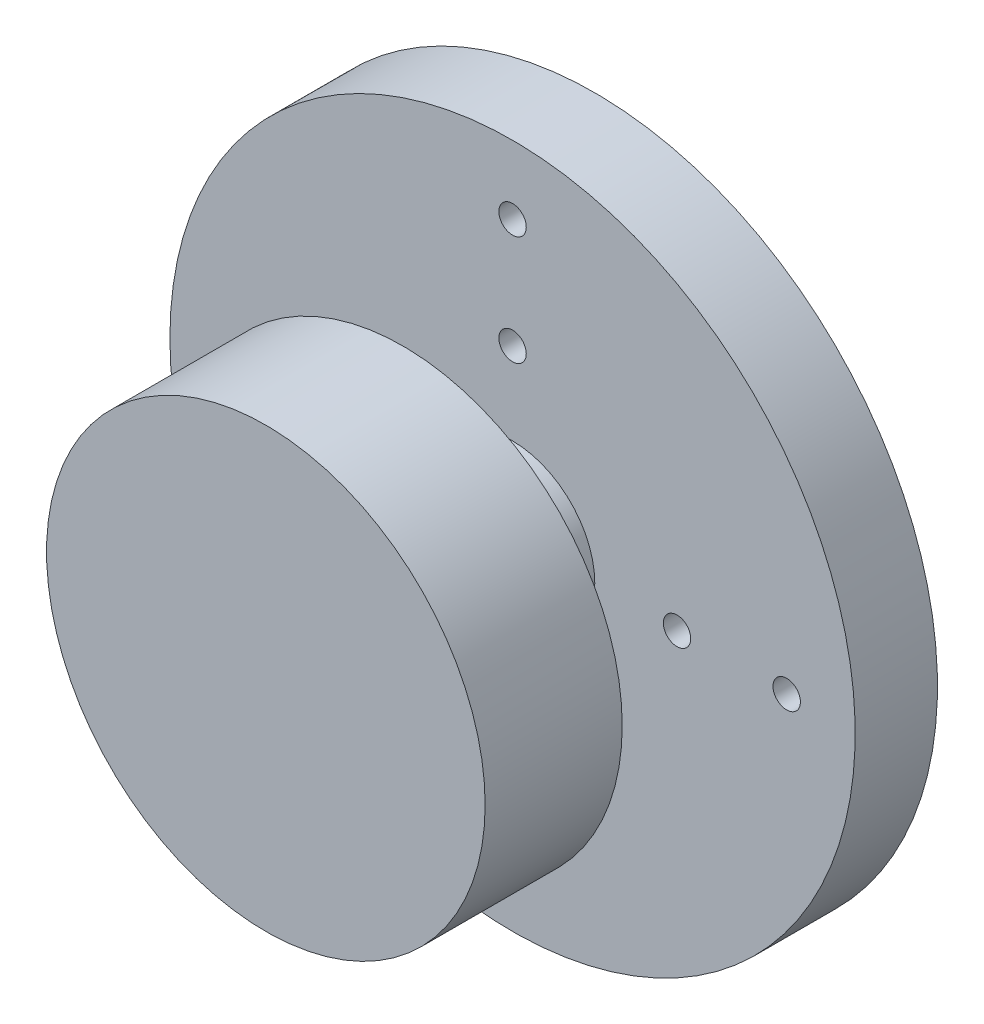
ISO-10303-21;
HEADER;
FILE_DESCRIPTION(('STEP AP214'),'2;1');
FILE_NAME('part.step','',(''),(''),'','','');
FILE_SCHEMA(('AUTOMOTIVE_DESIGN { 1 0 10303 214 1 1 1 1 }'));
ENDSEC;
DATA;
#1=APPLICATION_CONTEXT('core data for automotive mechanical design processes');
#2=APPLICATION_PROTOCOL_DEFINITION('international standard','automotive_design',2000,#1);
#3=PRODUCT_CONTEXT('',#1,'mechanical');
#4=PRODUCT('Part','Part','',(#3));
#5=PRODUCT_RELATED_PRODUCT_CATEGORY('part','',(#4));
#6=PRODUCT_DEFINITION_FORMATION('','',#4);
#7=PRODUCT_DEFINITION_CONTEXT('part definition',#1,'design');
#8=PRODUCT_DEFINITION('design','',#6,#7);
#9=PRODUCT_DEFINITION_SHAPE('','',#8);
#10=(LENGTH_UNIT() NAMED_UNIT(*) SI_UNIT(.MILLI.,.METRE.));
#11=(NAMED_UNIT(*) PLANE_ANGLE_UNIT() SI_UNIT($,.RADIAN.));
#12=(NAMED_UNIT(*) SI_UNIT($,.STERADIAN.) SOLID_ANGLE_UNIT());
#13=UNCERTAINTY_MEASURE_WITH_UNIT(LENGTH_MEASURE(1.E-05),#10,'distance_accuracy_value','');
#14=(GEOMETRIC_REPRESENTATION_CONTEXT(3) GLOBAL_UNCERTAINTY_ASSIGNED_CONTEXT((#13)) GLOBAL_UNIT_ASSIGNED_CONTEXT((#10,
#11,#12)) REPRESENTATION_CONTEXT('',''));
#15=CARTESIAN_POINT('',(0.,0.,0.));
#16=DIRECTION('',(0.,0.,1.));
#17=DIRECTION('',(1.,0.,0.));
#18=AXIS2_PLACEMENT_3D('',#15,#16,#17);
#19=CARTESIAN_POINT('',(0.,0.,0.));
#20=DIRECTION('',(0.,0.,1.));
#21=DIRECTION('',(1.,0.,0.));
#22=AXIS2_PLACEMENT_3D('',#19,#20,#21);
#23=PLANE('',#22);
#24=CARTESIAN_POINT('',(0.,0.,0.));
#25=DIRECTION('',(0.,0.,1.));
#26=DIRECTION('',(1.,0.,0.));
#27=AXIS2_PLACEMENT_3D('',#24,#25,#26);
#28=CIRCLE('',#27,8.);
#29=CARTESIAN_POINT('',(8.,0.,0.));
#30=VERTEX_POINT('',#29);
#31=EDGE_CURVE('E40',#30,#30,#28,.T.);
#32=ORIENTED_EDGE('',*,*,#31,.F.);
#33=EDGE_LOOP('',(#32));
#34=FACE_BOUND('',#33,.T.);
#35=CARTESIAN_POINT('',(0.,0.,0.));
#36=DIRECTION('',(0.,0.,1.));
#37=DIRECTION('',(1.,0.,0.));
#38=AXIS2_PLACEMENT_3D('',#35,#36,#37);
#39=CIRCLE('',#38,3.);
#40=CARTESIAN_POINT('',(3.,0.,0.));
#41=VERTEX_POINT('',#40);
#42=EDGE_CURVE('E10',#41,#41,#39,.F.);
#43=ORIENTED_EDGE('',*,*,#42,.F.);
#44=EDGE_LOOP('',(#43));
#45=FACE_BOUND('',#44,.T.);
#46=ADVANCED_FACE('F29',(#34,#45),#23,.F.);
#47=CARTESIAN_POINT('',(0.,0.,5.));
#48=DIRECTION('',(0.,0.,-1.));
#49=DIRECTION('',(-1.,0.,0.));
#50=AXIS2_PLACEMENT_3D('',#47,#48,#49);
#51=CYLINDRICAL_SURFACE('',#50,8.);
#52=CARTESIAN_POINT('',(0.,0.,5.));
#53=DIRECTION('',(0.,0.,1.));
#54=DIRECTION('',(1.,0.,0.));
#55=AXIS2_PLACEMENT_3D('',#52,#53,#54);
#56=CIRCLE('',#55,8.);
#57=CARTESIAN_POINT('',(8.,0.,5.));
#58=VERTEX_POINT('',#57);
#59=EDGE_CURVE('E36',#58,#58,#56,.T.);
#60=ORIENTED_EDGE('',*,*,#59,.F.);
#61=EDGE_LOOP('',(#60));
#62=FACE_BOUND('',#61,.T.);
#63=ORIENTED_EDGE('',*,*,#31,.T.);
#64=EDGE_LOOP('',(#63));
#65=FACE_BOUND('',#64,.T.);
#66=ADVANCED_FACE('F31',(#62,#65),#51,.T.);
#67=CARTESIAN_POINT('',(0.,0.,5.));
#68=DIRECTION('',(0.,0.,1.));
#69=DIRECTION('',(1.,0.,0.));
#70=AXIS2_PLACEMENT_3D('',#67,#68,#69);
#71=PLANE('',#70);
#72=ORIENTED_EDGE('',*,*,#59,.T.);
#73=EDGE_LOOP('',(#72));
#74=FACE_BOUND('',#73,.T.);
#75=ADVANCED_FACE('F139',(#74),#71,.T.);
#76=CARTESIAN_POINT('',(0.,0.,-4.));
#77=DIRECTION('',(0.,0.,1.));
#78=DIRECTION('',(1.,0.,0.));
#79=AXIS2_PLACEMENT_3D('',#76,#77,#78);
#80=CYLINDRICAL_SURFACE('',#79,3.);
#81=CARTESIAN_POINT('',(0.,0.,-4.));
#82=DIRECTION('',(0.,0.,-1.));
#83=DIRECTION('',(-1.,0.,0.));
#84=AXIS2_PLACEMENT_3D('',#81,#82,#83);
#85=CIRCLE('',#84,3.);
#86=CARTESIAN_POINT('',(-3.,0.,-4.));
#87=VERTEX_POINT('',#86);
#88=EDGE_CURVE('E45',#87,#87,#85,.T.);
#89=ORIENTED_EDGE('',*,*,#88,.F.);
#90=EDGE_LOOP('',(#89));
#91=FACE_BOUND('',#90,.T.);
#92=ORIENTED_EDGE('',*,*,#42,.T.);
#93=EDGE_LOOP('',(#92));
#94=FACE_BOUND('',#93,.T.);
#95=ADVANCED_FACE('F118',(#91,#94),#80,.T.);
#96=CARTESIAN_POINT('',(0.,0.,-4.));
#97=DIRECTION('',(0.,0.,-1.));
#98=DIRECTION('',(-1.,0.,0.));
#99=AXIS2_PLACEMENT_3D('',#96,#97,#98);
#100=PLANE('',#99);
#101=CARTESIAN_POINT('',(-10.,1.04744500833281E-13,-4.));
#102=DIRECTION('',(0.,0.,1.));
#103=DIRECTION('',(0.,1.,0.));
#104=AXIS2_PLACEMENT_3D('',#101,#102,#103);
#105=CIRCLE('',#104,0.5);
#106=CARTESIAN_POINT('',(-9.99999999999999,0.500000000000105,-4.));
#107=VERTEX_POINT('',#106);
#108=EDGE_CURVE('E98',#107,#107,#105,.T.);
#109=ORIENTED_EDGE('',*,*,#108,.F.);
#110=EDGE_LOOP('',(#109));
#111=FACE_BOUND('',#110,.T.);
#112=CARTESIAN_POINT('',(-6.,0.,-4.));
#113=DIRECTION('',(0.,0.,1.));
#114=DIRECTION('',(0.,1.,0.));
#115=AXIS2_PLACEMENT_3D('',#112,#113,#114);
#116=CIRCLE('',#115,0.5);
#117=CARTESIAN_POINT('',(-5.99999999999999,0.500000000000063,-4.));
#118=VERTEX_POINT('',#117);
#119=EDGE_CURVE('E92',#118,#118,#116,.T.);
#120=ORIENTED_EDGE('',*,*,#119,.F.);
#121=EDGE_LOOP('',(#120));
#122=FACE_BOUND('',#121,.T.);
#123=CARTESIAN_POINT('',(0.,-10.,-4.));
#124=DIRECTION('',(0.,0.,1.));
#125=DIRECTION('',(-1.,0.,0.));
#126=AXIS2_PLACEMENT_3D('',#123,#124,#125);
#127=CIRCLE('',#126,0.5);
#128=CARTESIAN_POINT('',(-0.50000000000007,-10.,-4.));
#129=VERTEX_POINT('',#128);
#130=EDGE_CURVE('E86',#129,#129,#127,.T.);
#131=ORIENTED_EDGE('',*,*,#130,.F.);
#132=EDGE_LOOP('',(#131));
#133=FACE_BOUND('',#132,.T.);
#134=CARTESIAN_POINT('',(0.,-6.,-4.));
#135=DIRECTION('',(0.,0.,1.));
#136=DIRECTION('',(-1.,0.,0.));
#137=AXIS2_PLACEMENT_3D('',#134,#135,#136);
#138=CIRCLE('',#137,0.5);
#139=CARTESIAN_POINT('',(-0.500000000000042,-6.,-4.));
#140=VERTEX_POINT('',#139);
#141=EDGE_CURVE('E80',#140,#140,#138,.T.);
#142=ORIENTED_EDGE('',*,*,#141,.F.);
#143=EDGE_LOOP('',(#142));
#144=FACE_BOUND('',#143,.T.);
#145=CARTESIAN_POINT('',(10.,0.,-4.));
#146=DIRECTION('',(0.,0.,1.));
#147=DIRECTION('',(0.,-1.,0.));
#148=AXIS2_PLACEMENT_3D('',#145,#146,#147);
#149=CIRCLE('',#148,0.5);
#150=CARTESIAN_POINT('',(10.,-0.500000000000035,-4.));
#151=VERTEX_POINT('',#150);
#152=EDGE_CURVE('E74',#151,#151,#149,.T.);
#153=ORIENTED_EDGE('',*,*,#152,.F.);
#154=EDGE_LOOP('',(#153));
#155=FACE_BOUND('',#154,.T.);
#156=CARTESIAN_POINT('',(6.,0.,-4.));
#157=DIRECTION('',(0.,0.,1.));
#158=DIRECTION('',(0.,-1.,0.));
#159=AXIS2_PLACEMENT_3D('',#156,#157,#158);
#160=CIRCLE('',#159,0.5);
#161=CARTESIAN_POINT('',(6.,-0.500000000000021,-4.));
#162=VERTEX_POINT('',#161);
#163=EDGE_CURVE('E68',#162,#162,#160,.T.);
#164=ORIENTED_EDGE('',*,*,#163,.F.);
#165=EDGE_LOOP('',(#164));
#166=FACE_BOUND('',#165,.T.);
#167=CARTESIAN_POINT('',(0.,10.,-4.));
#168=DIRECTION('',(0.,0.,1.));
#169=DIRECTION('',(1.,0.,0.));
#170=AXIS2_PLACEMENT_3D('',#167,#168,#169);
#171=CIRCLE('',#170,0.5);
#172=CARTESIAN_POINT('',(0.5,10.,-4.));
#173=VERTEX_POINT('',#172);
#174=EDGE_CURVE('E62',#173,#173,#171,.T.);
#175=ORIENTED_EDGE('',*,*,#174,.F.);
#176=EDGE_LOOP('',(#175));
#177=FACE_BOUND('',#176,.T.);
#178=CARTESIAN_POINT('',(0.,6.,-4.));
#179=DIRECTION('',(0.,0.,1.));
#180=DIRECTION('',(1.,0.,0.));
#181=AXIS2_PLACEMENT_3D('',#178,#179,#180);
#182=CIRCLE('',#181,0.5);
#183=CARTESIAN_POINT('',(0.5,6.,-4.));
#184=VERTEX_POINT('',#183);
#185=EDGE_CURVE('E56',#184,#184,#182,.T.);
#186=ORIENTED_EDGE('',*,*,#185,.F.);
#187=EDGE_LOOP('',(#186));
#188=FACE_BOUND('',#187,.T.);
#189=CARTESIAN_POINT('',(0.,0.,-4.));
#190=DIRECTION('',(0.,0.,-1.));
#191=DIRECTION('',(-1.,0.,0.));
#192=AXIS2_PLACEMENT_3D('',#189,#190,#191);
#193=CIRCLE('',#192,12.5);
#194=CARTESIAN_POINT('',(-12.5,0.,-4.));
#195=VERTEX_POINT('',#194);
#196=EDGE_CURVE('E50',#195,#195,#193,.T.);
#197=ORIENTED_EDGE('',*,*,#196,.F.);
#198=EDGE_LOOP('',(#197));
#199=FACE_BOUND('',#198,.T.);
#200=ORIENTED_EDGE('',*,*,#88,.T.);
#201=EDGE_LOOP('',(#200));
#202=FACE_BOUND('',#201,.T.);
#203=ADVANCED_FACE('F114',(#111,#122,#133,#144,#155,#166,#177,#188,#199,#202),#100,.F.);
#204=CARTESIAN_POINT('',(0.,0.,-7.));
#205=DIRECTION('',(0.,0.,1.));
#206=DIRECTION('',(1.,0.,0.));
#207=AXIS2_PLACEMENT_3D('',#204,#205,#206);
#208=CYLINDRICAL_SURFACE('',#207,12.5);
#209=CARTESIAN_POINT('',(0.,0.,-7.));
#210=DIRECTION('',(0.,0.,-1.));
#211=DIRECTION('',(-1.,0.,0.));
#212=AXIS2_PLACEMENT_3D('',#209,#210,#211);
#213=CIRCLE('',#212,12.5);
#214=CARTESIAN_POINT('',(-12.5,0.,-7.));
#215=VERTEX_POINT('',#214);
#216=EDGE_CURVE('E49',#215,#215,#213,.T.);
#217=ORIENTED_EDGE('',*,*,#216,.F.);
#218=EDGE_LOOP('',(#217));
#219=FACE_BOUND('',#218,.T.);
#220=ORIENTED_EDGE('',*,*,#196,.T.);
#221=EDGE_LOOP('',(#220));
#222=FACE_BOUND('',#221,.T.);
#223=ADVANCED_FACE('F117',(#219,#222),#208,.T.);
#224=CARTESIAN_POINT('',(0.,0.,-7.));
#225=DIRECTION('',(0.,0.,-1.));
#226=DIRECTION('',(-1.,0.,0.));
#227=AXIS2_PLACEMENT_3D('',#224,#225,#226);
#228=PLANE('',#227);
#229=CARTESIAN_POINT('',(-10.,1.04744500833281E-13,-7.));
#230=DIRECTION('',(0.,0.,1.));
#231=DIRECTION('',(0.,1.,0.));
#232=AXIS2_PLACEMENT_3D('',#229,#230,#231);
#233=CIRCLE('',#232,0.5);
#234=CARTESIAN_POINT('',(-9.99999999999999,0.500000000000105,-7.));
#235=VERTEX_POINT('',#234);
#236=EDGE_CURVE('E95',#235,#235,#233,.T.);
#237=ORIENTED_EDGE('',*,*,#236,.T.);
#238=EDGE_LOOP('',(#237));
#239=FACE_BOUND('',#238,.T.);
#240=CARTESIAN_POINT('',(-6.,0.,-7.));
#241=DIRECTION('',(0.,0.,1.));
#242=DIRECTION('',(0.,1.,0.));
#243=AXIS2_PLACEMENT_3D('',#240,#241,#242);
#244=CIRCLE('',#243,0.5);
#245=CARTESIAN_POINT('',(-5.99999999999999,0.500000000000063,-7.));
#246=VERTEX_POINT('',#245);
#247=EDGE_CURVE('E89',#246,#246,#244,.T.);
#248=ORIENTED_EDGE('',*,*,#247,.T.);
#249=EDGE_LOOP('',(#248));
#250=FACE_BOUND('',#249,.T.);
#251=CARTESIAN_POINT('',(0.,-10.,-7.));
#252=DIRECTION('',(0.,0.,1.));
#253=DIRECTION('',(-1.,0.,0.));
#254=AXIS2_PLACEMENT_3D('',#251,#252,#253);
#255=CIRCLE('',#254,0.5);
#256=CARTESIAN_POINT('',(-0.50000000000007,-10.,-7.));
#257=VERTEX_POINT('',#256);
#258=EDGE_CURVE('E83',#257,#257,#255,.T.);
#259=ORIENTED_EDGE('',*,*,#258,.T.);
#260=EDGE_LOOP('',(#259));
#261=FACE_BOUND('',#260,.T.);
#262=CARTESIAN_POINT('',(0.,-6.,-7.));
#263=DIRECTION('',(0.,0.,1.));
#264=DIRECTION('',(-1.,0.,0.));
#265=AXIS2_PLACEMENT_3D('',#262,#263,#264);
#266=CIRCLE('',#265,0.5);
#267=CARTESIAN_POINT('',(-0.500000000000042,-6.,-7.));
#268=VERTEX_POINT('',#267);
#269=EDGE_CURVE('E77',#268,#268,#266,.T.);
#270=ORIENTED_EDGE('',*,*,#269,.T.);
#271=EDGE_LOOP('',(#270));
#272=FACE_BOUND('',#271,.T.);
#273=CARTESIAN_POINT('',(10.,0.,-7.));
#274=DIRECTION('',(0.,0.,1.));
#275=DIRECTION('',(0.,-1.,0.));
#276=AXIS2_PLACEMENT_3D('',#273,#274,#275);
#277=CIRCLE('',#276,0.5);
#278=CARTESIAN_POINT('',(10.,-0.500000000000035,-7.));
#279=VERTEX_POINT('',#278);
#280=EDGE_CURVE('E71',#279,#279,#277,.T.);
#281=ORIENTED_EDGE('',*,*,#280,.T.);
#282=EDGE_LOOP('',(#281));
#283=FACE_BOUND('',#282,.T.);
#284=CARTESIAN_POINT('',(6.,0.,-7.));
#285=DIRECTION('',(0.,0.,1.));
#286=DIRECTION('',(0.,-1.,0.));
#287=AXIS2_PLACEMENT_3D('',#284,#285,#286);
#288=CIRCLE('',#287,0.5);
#289=CARTESIAN_POINT('',(6.,-0.500000000000021,-7.));
#290=VERTEX_POINT('',#289);
#291=EDGE_CURVE('E65',#290,#290,#288,.T.);
#292=ORIENTED_EDGE('',*,*,#291,.T.);
#293=EDGE_LOOP('',(#292));
#294=FACE_BOUND('',#293,.T.);
#295=CARTESIAN_POINT('',(0.,10.,-7.));
#296=DIRECTION('',(0.,0.,1.));
#297=DIRECTION('',(1.,0.,0.));
#298=AXIS2_PLACEMENT_3D('',#295,#296,#297);
#299=CIRCLE('',#298,0.5);
#300=CARTESIAN_POINT('',(0.5,10.,-7.));
#301=VERTEX_POINT('',#300);
#302=EDGE_CURVE('E59',#301,#301,#299,.T.);
#303=ORIENTED_EDGE('',*,*,#302,.T.);
#304=EDGE_LOOP('',(#303));
#305=FACE_BOUND('',#304,.T.);
#306=CARTESIAN_POINT('',(0.,6.,-7.));
#307=DIRECTION('',(0.,0.,1.));
#308=DIRECTION('',(1.,0.,0.));
#309=AXIS2_PLACEMENT_3D('',#306,#307,#308);
#310=CIRCLE('',#309,0.5);
#311=CARTESIAN_POINT('',(0.5,6.,-7.));
#312=VERTEX_POINT('',#311);
#313=EDGE_CURVE('E53',#312,#312,#310,.T.);
#314=ORIENTED_EDGE('',*,*,#313,.T.);
#315=EDGE_LOOP('',(#314));
#316=FACE_BOUND('',#315,.T.);
#317=ORIENTED_EDGE('',*,*,#216,.T.);
#318=EDGE_LOOP('',(#317));
#319=FACE_BOUND('',#318,.T.);
#320=ADVANCED_FACE('F104',(#239,#250,#261,#272,#283,#294,#305,#316,#319),#228,.T.);
#321=CARTESIAN_POINT('',(0.,6.,-7.));
#322=DIRECTION('',(0.,0.,1.));
#323=DIRECTION('',(1.,0.,0.));
#324=AXIS2_PLACEMENT_3D('',#321,#322,#323);
#325=CYLINDRICAL_SURFACE('',#324,0.5);
#326=ORIENTED_EDGE('',*,*,#313,.F.);
#327=EDGE_LOOP('',(#326));
#328=FACE_BOUND('',#327,.T.);
#329=ORIENTED_EDGE('',*,*,#185,.T.);
#330=EDGE_LOOP('',(#329));
#331=FACE_BOUND('',#330,.T.);
#332=ADVANCED_FACE('F185',(#328,#331),#325,.F.);
#333=CARTESIAN_POINT('',(0.,10.,-7.));
#334=DIRECTION('',(0.,0.,1.));
#335=DIRECTION('',(1.,0.,0.));
#336=AXIS2_PLACEMENT_3D('',#333,#334,#335);
#337=CYLINDRICAL_SURFACE('',#336,0.5);
#338=ORIENTED_EDGE('',*,*,#302,.F.);
#339=EDGE_LOOP('',(#338));
#340=FACE_BOUND('',#339,.T.);
#341=ORIENTED_EDGE('',*,*,#174,.T.);
#342=EDGE_LOOP('',(#341));
#343=FACE_BOUND('',#342,.T.);
#344=ADVANCED_FACE('F190',(#340,#343),#337,.F.);
#345=CARTESIAN_POINT('',(6.,0.,-7.));
#346=DIRECTION('',(0.,0.,1.));
#347=DIRECTION('',(1.,0.,0.));
#348=AXIS2_PLACEMENT_3D('',#345,#346,#347);
#349=CYLINDRICAL_SURFACE('',#348,0.5);
#350=ORIENTED_EDGE('',*,*,#291,.F.);
#351=EDGE_LOOP('',(#350));
#352=FACE_BOUND('',#351,.T.);
#353=ORIENTED_EDGE('',*,*,#163,.T.);
#354=EDGE_LOOP('',(#353));
#355=FACE_BOUND('',#354,.T.);
#356=ADVANCED_FACE('F200',(#352,#355),#349,.F.);
#357=CARTESIAN_POINT('',(10.,0.,-7.));
#358=DIRECTION('',(0.,0.,1.));
#359=DIRECTION('',(1.,0.,0.));
#360=AXIS2_PLACEMENT_3D('',#357,#358,#359);
#361=CYLINDRICAL_SURFACE('',#360,0.5);
#362=ORIENTED_EDGE('',*,*,#280,.F.);
#363=EDGE_LOOP('',(#362));
#364=FACE_BOUND('',#363,.T.);
#365=ORIENTED_EDGE('',*,*,#152,.T.);
#366=EDGE_LOOP('',(#365));
#367=FACE_BOUND('',#366,.T.);
#368=ADVANCED_FACE('F221',(#364,#367),#361,.F.);
#369=CARTESIAN_POINT('',(0.,-6.,-7.));
#370=DIRECTION('',(0.,0.,1.));
#371=DIRECTION('',(1.,0.,0.));
#372=AXIS2_PLACEMENT_3D('',#369,#370,#371);
#373=CYLINDRICAL_SURFACE('',#372,0.5);
#374=ORIENTED_EDGE('',*,*,#269,.F.);
#375=EDGE_LOOP('',(#374));
#376=FACE_BOUND('',#375,.T.);
#377=ORIENTED_EDGE('',*,*,#141,.T.);
#378=EDGE_LOOP('',(#377));
#379=FACE_BOUND('',#378,.T.);
#380=ADVANCED_FACE('F231',(#376,#379),#373,.F.);
#381=CARTESIAN_POINT('',(0.,-10.,-7.));
#382=DIRECTION('',(0.,0.,1.));
#383=DIRECTION('',(1.,0.,0.));
#384=AXIS2_PLACEMENT_3D('',#381,#382,#383);
#385=CYLINDRICAL_SURFACE('',#384,0.5);
#386=ORIENTED_EDGE('',*,*,#258,.F.);
#387=EDGE_LOOP('',(#386));
#388=FACE_BOUND('',#387,.T.);
#389=ORIENTED_EDGE('',*,*,#130,.T.);
#390=EDGE_LOOP('',(#389));
#391=FACE_BOUND('',#390,.T.);
#392=ADVANCED_FACE('F241',(#388,#391),#385,.F.);
#393=CARTESIAN_POINT('',(-6.,0.,-7.));
#394=DIRECTION('',(0.,0.,1.));
#395=DIRECTION('',(1.,0.,0.));
#396=AXIS2_PLACEMENT_3D('',#393,#394,#395);
#397=CYLINDRICAL_SURFACE('',#396,0.5);
#398=ORIENTED_EDGE('',*,*,#247,.F.);
#399=EDGE_LOOP('',(#398));
#400=FACE_BOUND('',#399,.T.);
#401=ORIENTED_EDGE('',*,*,#119,.T.);
#402=EDGE_LOOP('',(#401));
#403=FACE_BOUND('',#402,.T.);
#404=ADVANCED_FACE('F110',(#400,#403),#397,.F.);
#405=CARTESIAN_POINT('',(-10.,1.04744500833281E-13,-7.));
#406=DIRECTION('',(0.,0.,1.));
#407=DIRECTION('',(1.,0.,0.));
#408=AXIS2_PLACEMENT_3D('',#405,#406,#407);
#409=CYLINDRICAL_SURFACE('',#408,0.5);
#410=ORIENTED_EDGE('',*,*,#236,.F.);
#411=EDGE_LOOP('',(#410));
#412=FACE_BOUND('',#411,.T.);
#413=ORIENTED_EDGE('',*,*,#108,.T.);
#414=EDGE_LOOP('',(#413));
#415=FACE_BOUND('',#414,.T.);
#416=ADVANCED_FACE('F107',(#412,#415),#409,.F.);
#417=CLOSED_SHELL('',(#46,#66,#75,#95,#203,#223,#320,#332,#344,#356,#368,#380,#392,#404,#416));
#418=MANIFOLD_SOLID_BREP('B2',#417);
#419=ADVANCED_BREP_SHAPE_REPRESENTATION('',(#18,#418),#14);
#420=SHAPE_DEFINITION_REPRESENTATION(#9,#419);
ENDSEC;
END-ISO-10303-21;
